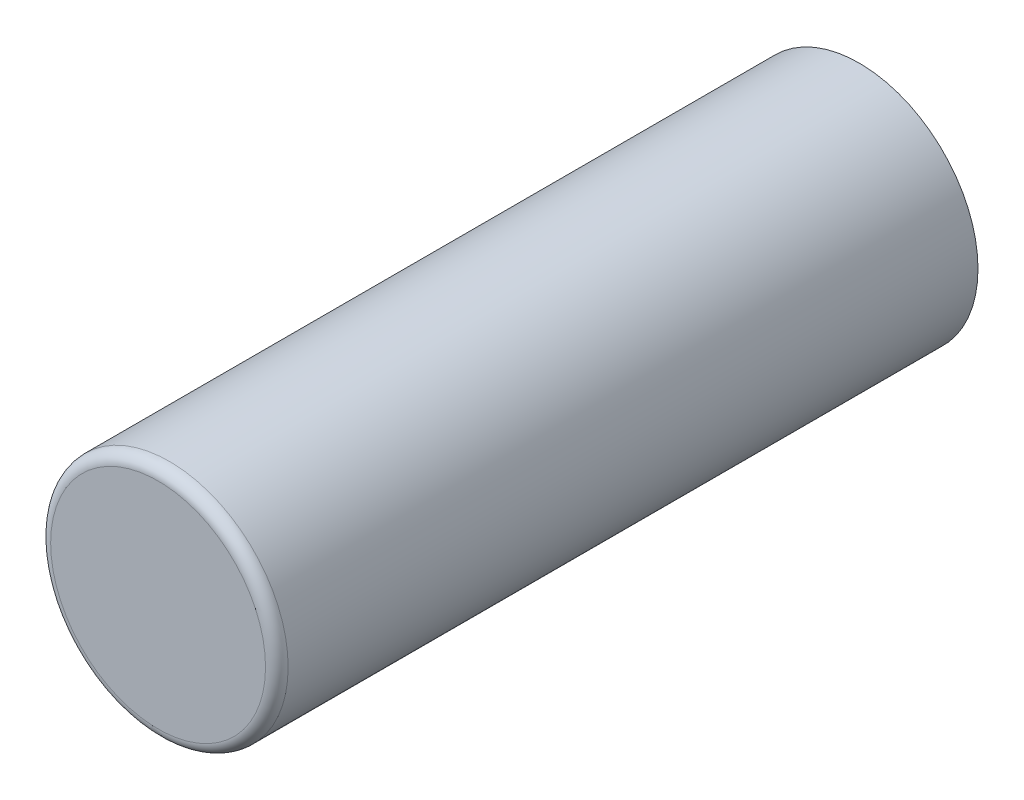
ISO-10303-21;
HEADER;
FILE_DESCRIPTION(('STEP AP214'),'2;1');
FILE_NAME('part.step','',(''),(''),'','','');
FILE_SCHEMA(('AUTOMOTIVE_DESIGN { 1 0 10303 214 1 1 1 1 }'));
ENDSEC;
DATA;
#1=APPLICATION_CONTEXT('core data for automotive mechanical design processes');
#2=APPLICATION_PROTOCOL_DEFINITION('international standard','automotive_design',2000,#1);
#3=PRODUCT_CONTEXT('',#1,'mechanical');
#4=PRODUCT('Part','Part','',(#3));
#5=PRODUCT_RELATED_PRODUCT_CATEGORY('part','',(#4));
#6=PRODUCT_DEFINITION_FORMATION('','',#4);
#7=PRODUCT_DEFINITION_CONTEXT('part definition',#1,'design');
#8=PRODUCT_DEFINITION('design','',#6,#7);
#9=PRODUCT_DEFINITION_SHAPE('','',#8);
#10=(LENGTH_UNIT() NAMED_UNIT(*) SI_UNIT(.MILLI.,.METRE.));
#11=(NAMED_UNIT(*) PLANE_ANGLE_UNIT() SI_UNIT($,.RADIAN.));
#12=(NAMED_UNIT(*) SI_UNIT($,.STERADIAN.) SOLID_ANGLE_UNIT());
#13=UNCERTAINTY_MEASURE_WITH_UNIT(LENGTH_MEASURE(1.E-05),#10,'distance_accuracy_value','');
#14=(GEOMETRIC_REPRESENTATION_CONTEXT(3) GLOBAL_UNCERTAINTY_ASSIGNED_CONTEXT((#13)) GLOBAL_UNIT_ASSIGNED_CONTEXT((#10,
#11,#12)) REPRESENTATION_CONTEXT('',''));
#15=CARTESIAN_POINT('',(0.,0.,0.));
#16=DIRECTION('',(0.,0.,1.));
#17=DIRECTION('',(1.,0.,0.));
#18=AXIS2_PLACEMENT_3D('',#15,#16,#17);
#19=CARTESIAN_POINT('',(1.27,0.,8.199999809265));
#20=DIRECTION('',(0.,0.,1.));
#21=DIRECTION('',(1.,0.,0.));
#22=AXIS2_PLACEMENT_3D('',#19,#20,#21);
#23=PLANE('',#22);
#24=CARTESIAN_POINT('',(1.27,0.,8.199999809265));
#25=DIRECTION('',(0.,0.,1.));
#26=DIRECTION('',(1.,0.,0.));
#27=AXIS2_PLACEMENT_3D('',#24,#25,#26);
#28=CIRCLE('',#27,0.949999952316);
#29=CARTESIAN_POINT('',(2.219999952316,0.,8.199999809265));
#30=VERTEX_POINT('',#29);
#31=EDGE_CURVE('E19',#30,#30,#28,.F.);
#32=ORIENTED_EDGE('',*,*,#31,.F.);
#33=EDGE_LOOP('',(#32));
#34=FACE_BOUND('',#33,.T.);
#35=ADVANCED_FACE('F15',(#34),#23,.T.);
#36=CARTESIAN_POINT('',(1.27,0.,2.));
#37=DIRECTION('',(0.,0.,1.));
#38=DIRECTION('',(1.,0.,0.));
#39=AXIS2_PLACEMENT_3D('',#36,#37,#38);
#40=PLANE('',#39);
#41=CARTESIAN_POINT('',(1.27,0.,2.));
#42=DIRECTION('',(0.,0.,1.));
#43=DIRECTION('',(1.,0.,0.));
#44=AXIS2_PLACEMENT_3D('',#41,#42,#43);
#45=CIRCLE('',#44,1.049999952316);
#46=CARTESIAN_POINT('',(2.319999952316,0.,2.));
#47=VERTEX_POINT('',#46);
#48=EDGE_CURVE('E23',#47,#47,#45,.T.);
#49=ORIENTED_EDGE('',*,*,#48,.F.);
#50=EDGE_LOOP('',(#49));
#51=FACE_BOUND('',#50,.T.);
#52=ADVANCED_FACE('F36',(#51),#40,.F.);
#53=CARTESIAN_POINT('',(1.27,0.,8.099999809265));
#54=DIRECTION('',(0.,0.,1.));
#55=DIRECTION('',(1.,0.,0.));
#56=AXIS2_PLACEMENT_3D('',#53,#54,#55);
#57=TOROIDAL_SURFACE('',#56,0.949999952316,0.0999999999999998);
#58=ORIENTED_EDGE('',*,*,#31,.T.);
#59=EDGE_LOOP('',(#58));
#60=FACE_BOUND('',#59,.T.);
#61=CARTESIAN_POINT('',(1.27,0.,8.099999809265));
#62=DIRECTION('',(0.,0.,1.));
#63=DIRECTION('',(1.,0.,0.));
#64=AXIS2_PLACEMENT_3D('',#61,#62,#63);
#65=CIRCLE('',#64,1.049999952316);
#66=CARTESIAN_POINT('',(2.319999952316,0.,8.099999809265));
#67=VERTEX_POINT('',#66);
#68=EDGE_CURVE('E10',#67,#67,#65,.F.);
#69=ORIENTED_EDGE('',*,*,#68,.F.);
#70=EDGE_LOOP('',(#69));
#71=FACE_BOUND('',#70,.T.);
#72=ADVANCED_FACE('F17',(#60,#71),#57,.T.);
#73=CARTESIAN_POINT('',(1.27,0.,2.));
#74=DIRECTION('',(0.,0.,1.));
#75=DIRECTION('',(1.,0.,0.));
#76=AXIS2_PLACEMENT_3D('',#73,#74,#75);
#77=CYLINDRICAL_SURFACE('',#76,1.049999952316);
#78=ORIENTED_EDGE('',*,*,#68,.T.);
#79=EDGE_LOOP('',(#78));
#80=FACE_BOUND('',#79,.T.);
#81=ORIENTED_EDGE('',*,*,#48,.T.);
#82=EDGE_LOOP('',(#81));
#83=FACE_BOUND('',#82,.T.);
#84=ADVANCED_FACE('F43',(#80,#83),#77,.T.);
#85=CLOSED_SHELL('',(#35,#52,#72,#84));
#86=MANIFOLD_SOLID_BREP('B1',#85);
#87=ADVANCED_BREP_SHAPE_REPRESENTATION('',(#18,#86),#14);
#88=SHAPE_DEFINITION_REPRESENTATION(#9,#87);
ENDSEC;
END-ISO-10303-21;
